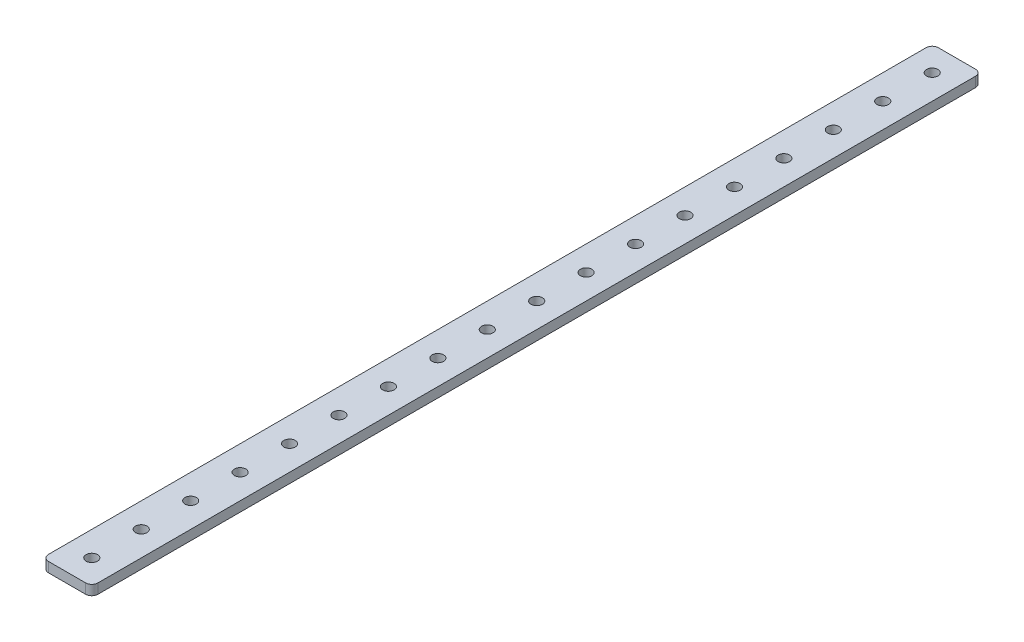
ISO-10303-21;
HEADER;
FILE_DESCRIPTION(('STEP AP214'),'2;1');
FILE_NAME('part.step','',(''),(''),'','','');
FILE_SCHEMA(('AUTOMOTIVE_DESIGN { 1 0 10303 214 1 1 1 1 }'));
ENDSEC;
DATA;
#1=APPLICATION_CONTEXT('core data for automotive mechanical design processes');
#2=APPLICATION_PROTOCOL_DEFINITION('international standard','automotive_design',2000,#1);
#3=PRODUCT_CONTEXT('',#1,'mechanical');
#4=PRODUCT('Part','Part','',(#3));
#5=PRODUCT_RELATED_PRODUCT_CATEGORY('part','',(#4));
#6=PRODUCT_DEFINITION_FORMATION('','',#4);
#7=PRODUCT_DEFINITION_CONTEXT('part definition',#1,'design');
#8=PRODUCT_DEFINITION('design','',#6,#7);
#9=PRODUCT_DEFINITION_SHAPE('','',#8);
#10=(LENGTH_UNIT() NAMED_UNIT(*) SI_UNIT(.MILLI.,.METRE.));
#11=(NAMED_UNIT(*) PLANE_ANGLE_UNIT() SI_UNIT($,.RADIAN.));
#12=(NAMED_UNIT(*) SI_UNIT($,.STERADIAN.) SOLID_ANGLE_UNIT());
#13=UNCERTAINTY_MEASURE_WITH_UNIT(LENGTH_MEASURE(1.E-05),#10,'distance_accuracy_value','');
#14=(GEOMETRIC_REPRESENTATION_CONTEXT(3) GLOBAL_UNCERTAINTY_ASSIGNED_CONTEXT((#13)) GLOBAL_UNIT_ASSIGNED_CONTEXT((#10,
#11,#12)) REPRESENTATION_CONTEXT('',''));
#15=CARTESIAN_POINT('',(0.,0.,0.));
#16=DIRECTION('',(0.,0.,1.));
#17=DIRECTION('',(1.,0.,0.));
#18=AXIS2_PLACEMENT_3D('',#15,#16,#17);
#19=CARTESIAN_POINT('',(6.,0.,-2.));
#20=DIRECTION('',(0.,1.,0.));
#21=DIRECTION('',(0.,0.,1.));
#22=AXIS2_PLACEMENT_3D('',#19,#20,#21);
#23=CYLINDRICAL_SURFACE('',#22,2.);
#24=CARTESIAN_POINT('',(6.,3.2,-2.));
#25=DIRECTION('',(0.,1.,0.));
#26=DIRECTION('',(0.,0.,1.));
#27=AXIS2_PLACEMENT_3D('',#24,#25,#26);
#28=CIRCLE('',#27,2.);
#29=CARTESIAN_POINT('',(6.,3.2,0.));
#30=VERTEX_POINT('',#29);
#31=CARTESIAN_POINT('',(8.,3.2,-2.));
#32=VERTEX_POINT('',#31);
#33=EDGE_CURVE('E130',#30,#32,#28,.T.);
#34=ORIENTED_EDGE('',*,*,#33,.F.);
#35=DIRECTION('',(0.,1.,0.));
#36=VECTOR('',#35,1.);
#37=CARTESIAN_POINT('',(6.,0.,0.));
#38=LINE('',#37,#36);
#39=CARTESIAN_POINT('',(6.,0.,0.));
#40=VERTEX_POINT('',#39);
#41=EDGE_CURVE('E11',#40,#30,#38,.T.);
#42=ORIENTED_EDGE('',*,*,#41,.F.);
#43=CARTESIAN_POINT('',(6.,0.,-2.));
#44=DIRECTION('',(0.,1.,0.));
#45=DIRECTION('',(0.,0.,1.));
#46=AXIS2_PLACEMENT_3D('',#43,#44,#45);
#47=CIRCLE('',#46,2.);
#48=CARTESIAN_POINT('',(8.,0.,-2.));
#49=VERTEX_POINT('',#48);
#50=EDGE_CURVE('E151',#40,#49,#47,.T.);
#51=ORIENTED_EDGE('',*,*,#50,.T.);
#52=DIRECTION('',(0.,1.,0.));
#53=VECTOR('',#52,1.);
#54=CARTESIAN_POINT('',(8.,0.,-2.));
#55=LINE('',#54,#53);
#56=EDGE_CURVE('E36',#49,#32,#55,.T.);
#57=ORIENTED_EDGE('',*,*,#56,.T.);
#58=EDGE_LOOP('',(#34,#42,#51,#57));
#59=FACE_BOUND('',#58,.T.);
#60=ADVANCED_FACE('F33',(#59),#23,.T.);
#61=CARTESIAN_POINT('',(-6.,0.,0.));
#62=DIRECTION('',(0.,0.,1.));
#63=DIRECTION('',(1.,0.,0.));
#64=AXIS2_PLACEMENT_3D('',#61,#62,#63);
#65=PLANE('',#64);
#66=DIRECTION('',(1.,0.,0.));
#67=VECTOR('',#66,1.);
#68=CARTESIAN_POINT('',(-6.,3.2,0.));
#69=LINE('',#68,#67);
#70=CARTESIAN_POINT('',(-6.,3.2,0.));
#71=VERTEX_POINT('',#70);
#72=EDGE_CURVE('E149',#71,#30,#69,.T.);
#73=ORIENTED_EDGE('',*,*,#72,.F.);
#74=DIRECTION('',(0.,1.,0.));
#75=VECTOR('',#74,1.);
#76=CARTESIAN_POINT('',(-6.,0.,0.));
#77=LINE('',#76,#75);
#78=CARTESIAN_POINT('',(-6.,0.,0.));
#79=VERTEX_POINT('',#78);
#80=EDGE_CURVE('E42',#79,#71,#77,.T.);
#81=ORIENTED_EDGE('',*,*,#80,.F.);
#82=DIRECTION('',(1.,0.,0.));
#83=VECTOR('',#82,1.);
#84=CARTESIAN_POINT('',(-6.,0.,0.));
#85=LINE('',#84,#83);
#86=EDGE_CURVE('E120',#79,#40,#85,.T.);
#87=ORIENTED_EDGE('',*,*,#86,.T.);
#88=ORIENTED_EDGE('',*,*,#41,.T.);
#89=EDGE_LOOP('',(#73,#81,#87,#88));
#90=FACE_BOUND('',#89,.T.);
#91=ADVANCED_FACE('F163',(#90),#65,.T.);
#92=CARTESIAN_POINT('',(-6.,0.,-2.));
#93=DIRECTION('',(0.,1.,0.));
#94=DIRECTION('',(0.,0.,1.));
#95=AXIS2_PLACEMENT_3D('',#92,#93,#94);
#96=CYLINDRICAL_SURFACE('',#95,2.);
#97=CARTESIAN_POINT('',(-6.,3.2,-2.));
#98=DIRECTION('',(0.,1.,0.));
#99=DIRECTION('',(0.,0.,1.));
#100=AXIS2_PLACEMENT_3D('',#97,#98,#99);
#101=CIRCLE('',#100,2.);
#102=CARTESIAN_POINT('',(-8.,3.2,-2.));
#103=VERTEX_POINT('',#102);
#104=EDGE_CURVE('E107',#103,#71,#101,.T.);
#105=ORIENTED_EDGE('',*,*,#104,.F.);
#106=DIRECTION('',(0.,1.,0.));
#107=VECTOR('',#106,1.);
#108=CARTESIAN_POINT('',(-8.,0.,-2.));
#109=LINE('',#108,#107);
#110=CARTESIAN_POINT('',(-8.,0.,-2.));
#111=VERTEX_POINT('',#110);
#112=EDGE_CURVE('E102',#111,#103,#109,.T.);
#113=ORIENTED_EDGE('',*,*,#112,.F.);
#114=CARTESIAN_POINT('',(-6.,0.,-2.));
#115=DIRECTION('',(0.,1.,0.));
#116=DIRECTION('',(0.,0.,1.));
#117=AXIS2_PLACEMENT_3D('',#114,#115,#116);
#118=CIRCLE('',#117,2.);
#119=EDGE_CURVE('E105',#111,#79,#118,.T.);
#120=ORIENTED_EDGE('',*,*,#119,.T.);
#121=ORIENTED_EDGE('',*,*,#80,.T.);
#122=EDGE_LOOP('',(#105,#113,#120,#121));
#123=FACE_BOUND('',#122,.T.);
#124=ADVANCED_FACE('F104',(#123),#96,.T.);
#125=CARTESIAN_POINT('',(-8.,0.,-286.));
#126=DIRECTION('',(-1.,0.,0.));
#127=DIRECTION('',(0.,0.,1.));
#128=AXIS2_PLACEMENT_3D('',#125,#126,#127);
#129=PLANE('',#128);
#130=DIRECTION('',(0.,0.,1.));
#131=VECTOR('',#130,1.);
#132=CARTESIAN_POINT('',(-8.,3.2,-286.));
#133=LINE('',#132,#131);
#134=CARTESIAN_POINT('',(-8.,3.2,-286.));
#135=VERTEX_POINT('',#134);
#136=EDGE_CURVE('E146',#135,#103,#133,.T.);
#137=ORIENTED_EDGE('',*,*,#136,.F.);
#138=DIRECTION('',(0.,1.,0.));
#139=VECTOR('',#138,1.);
#140=CARTESIAN_POINT('',(-8.,0.,-286.));
#141=LINE('',#140,#139);
#142=CARTESIAN_POINT('',(-8.,0.,-286.));
#143=VERTEX_POINT('',#142);
#144=EDGE_CURVE('E112',#143,#135,#141,.T.);
#145=ORIENTED_EDGE('',*,*,#144,.F.);
#146=DIRECTION('',(0.,0.,1.));
#147=VECTOR('',#146,1.);
#148=CARTESIAN_POINT('',(-8.,0.,-286.));
#149=LINE('',#148,#147);
#150=EDGE_CURVE('E118',#143,#111,#149,.T.);
#151=ORIENTED_EDGE('',*,*,#150,.T.);
#152=ORIENTED_EDGE('',*,*,#112,.T.);
#153=EDGE_LOOP('',(#137,#145,#151,#152));
#154=FACE_BOUND('',#153,.T.);
#155=ADVANCED_FACE('F122',(#154),#129,.T.);
#156=CARTESIAN_POINT('',(-6.,0.,-286.));
#157=DIRECTION('',(0.,1.,0.));
#158=DIRECTION('',(0.,0.,1.));
#159=AXIS2_PLACEMENT_3D('',#156,#157,#158);
#160=CYLINDRICAL_SURFACE('',#159,2.);
#161=CARTESIAN_POINT('',(-6.,3.2,-286.));
#162=DIRECTION('',(0.,1.,0.));
#163=DIRECTION('',(0.,0.,1.));
#164=AXIS2_PLACEMENT_3D('',#161,#162,#163);
#165=CIRCLE('',#164,2.);
#166=CARTESIAN_POINT('',(-6.,3.2,-288.));
#167=VERTEX_POINT('',#166);
#168=EDGE_CURVE('E143',#167,#135,#165,.T.);
#169=ORIENTED_EDGE('',*,*,#168,.F.);
#170=DIRECTION('',(0.,1.,0.));
#171=VECTOR('',#170,1.);
#172=CARTESIAN_POINT('',(-6.,0.,-288.));
#173=LINE('',#172,#171);
#174=CARTESIAN_POINT('',(-6.,0.,-288.));
#175=VERTEX_POINT('',#174);
#176=EDGE_CURVE('E155',#175,#167,#173,.T.);
#177=ORIENTED_EDGE('',*,*,#176,.F.);
#178=CARTESIAN_POINT('',(-6.,0.,-286.));
#179=DIRECTION('',(0.,1.,0.));
#180=DIRECTION('',(0.,0.,1.));
#181=AXIS2_PLACEMENT_3D('',#178,#179,#180);
#182=CIRCLE('',#181,2.);
#183=EDGE_CURVE('E123',#175,#143,#182,.T.);
#184=ORIENTED_EDGE('',*,*,#183,.T.);
#185=ORIENTED_EDGE('',*,*,#144,.T.);
#186=EDGE_LOOP('',(#169,#177,#184,#185));
#187=FACE_BOUND('',#186,.T.);
#188=ADVANCED_FACE('F176',(#187),#160,.T.);
#189=CARTESIAN_POINT('',(6.,0.,-288.));
#190=DIRECTION('',(0.,0.,-1.));
#191=DIRECTION('',(-1.,0.,0.));
#192=AXIS2_PLACEMENT_3D('',#189,#190,#191);
#193=PLANE('',#192);
#194=DIRECTION('',(-1.,0.,0.));
#195=VECTOR('',#194,1.);
#196=CARTESIAN_POINT('',(6.,3.2,-288.));
#197=LINE('',#196,#195);
#198=CARTESIAN_POINT('',(6.,3.2,-288.));
#199=VERTEX_POINT('',#198);
#200=EDGE_CURVE('E140',#199,#167,#197,.T.);
#201=ORIENTED_EDGE('',*,*,#200,.F.);
#202=DIRECTION('',(0.,1.,0.));
#203=VECTOR('',#202,1.);
#204=CARTESIAN_POINT('',(6.,0.,-288.));
#205=LINE('',#204,#203);
#206=CARTESIAN_POINT('',(6.,0.,-288.));
#207=VERTEX_POINT('',#206);
#208=EDGE_CURVE('E157',#207,#199,#205,.T.);
#209=ORIENTED_EDGE('',*,*,#208,.F.);
#210=DIRECTION('',(-1.,0.,0.));
#211=VECTOR('',#210,1.);
#212=CARTESIAN_POINT('',(6.,0.,-288.));
#213=LINE('',#212,#211);
#214=EDGE_CURVE('E125',#207,#175,#213,.T.);
#215=ORIENTED_EDGE('',*,*,#214,.T.);
#216=ORIENTED_EDGE('',*,*,#176,.T.);
#217=EDGE_LOOP('',(#201,#209,#215,#216));
#218=FACE_BOUND('',#217,.T.);
#219=ADVANCED_FACE('F179',(#218),#193,.T.);
#220=CARTESIAN_POINT('',(6.,0.,-286.));
#221=DIRECTION('',(0.,1.,0.));
#222=DIRECTION('',(0.,0.,1.));
#223=AXIS2_PLACEMENT_3D('',#220,#221,#222);
#224=CYLINDRICAL_SURFACE('',#223,2.);
#225=CARTESIAN_POINT('',(6.,3.2,-286.));
#226=DIRECTION('',(0.,1.,0.));
#227=DIRECTION('',(0.,0.,1.));
#228=AXIS2_PLACEMENT_3D('',#225,#226,#227);
#229=CIRCLE('',#228,2.);
#230=CARTESIAN_POINT('',(8.,3.2,-286.));
#231=VERTEX_POINT('',#230);
#232=EDGE_CURVE('E137',#231,#199,#229,.T.);
#233=ORIENTED_EDGE('',*,*,#232,.F.);
#234=DIRECTION('',(0.,1.,0.));
#235=VECTOR('',#234,1.);
#236=CARTESIAN_POINT('',(8.,0.,-286.));
#237=LINE('',#236,#235);
#238=CARTESIAN_POINT('',(8.,0.,-286.));
#239=VERTEX_POINT('',#238);
#240=EDGE_CURVE('E158',#239,#231,#237,.T.);
#241=ORIENTED_EDGE('',*,*,#240,.F.);
#242=CARTESIAN_POINT('',(6.,0.,-286.));
#243=DIRECTION('',(0.,1.,0.));
#244=DIRECTION('',(0.,0.,1.));
#245=AXIS2_PLACEMENT_3D('',#242,#243,#244);
#246=CIRCLE('',#245,2.);
#247=EDGE_CURVE('E385',#239,#207,#246,.T.);
#248=ORIENTED_EDGE('',*,*,#247,.T.);
#249=ORIENTED_EDGE('',*,*,#208,.T.);
#250=EDGE_LOOP('',(#233,#241,#248,#249));
#251=FACE_BOUND('',#250,.T.);
#252=ADVANCED_FACE('F183',(#251),#224,.T.);
#253=CARTESIAN_POINT('',(8.,0.,-2.));
#254=DIRECTION('',(1.,0.,0.));
#255=DIRECTION('',(0.,0.,-1.));
#256=AXIS2_PLACEMENT_3D('',#253,#254,#255);
#257=PLANE('',#256);
#258=DIRECTION('',(0.,0.,-1.));
#259=VECTOR('',#258,1.);
#260=CARTESIAN_POINT('',(8.,3.2,-2.));
#261=LINE('',#260,#259);
#262=EDGE_CURVE('E133',#32,#231,#261,.T.);
#263=ORIENTED_EDGE('',*,*,#262,.F.);
#264=ORIENTED_EDGE('',*,*,#56,.F.);
#265=DIRECTION('',(0.,0.,-1.));
#266=VECTOR('',#265,1.);
#267=CARTESIAN_POINT('',(8.,0.,-2.));
#268=LINE('',#267,#266);
#269=EDGE_CURVE('E383',#49,#239,#268,.T.);
#270=ORIENTED_EDGE('',*,*,#269,.T.);
#271=ORIENTED_EDGE('',*,*,#240,.T.);
#272=EDGE_LOOP('',(#263,#264,#270,#271));
#273=FACE_BOUND('',#272,.T.);
#274=ADVANCED_FACE('F160',(#273),#257,.T.);
#275=CARTESIAN_POINT('',(6.,0.,-2.));
#276=DIRECTION('',(0.,1.,0.));
#277=DIRECTION('',(0.,0.,1.));
#278=AXIS2_PLACEMENT_3D('',#275,#276,#277);
#279=PLANE('',#278);
#280=CARTESIAN_POINT('',(0.,0.,-8.));
#281=DIRECTION('',(0.,1.,0.));
#282=DIRECTION('',(0.,0.,-1.));
#283=AXIS2_PLACEMENT_3D('',#280,#281,#282);
#284=CIRCLE('',#283,1.85);
#285=CARTESIAN_POINT('',(0.,0.,-9.85));
#286=VERTEX_POINT('',#285);
#287=EDGE_CURVE('E274',#286,#286,#284,.T.);
#288=ORIENTED_EDGE('',*,*,#287,.T.);
#289=EDGE_LOOP('',(#288));
#290=FACE_BOUND('',#289,.T.);
#291=CARTESIAN_POINT('',(0.,0.,-24.));
#292=DIRECTION('',(0.,1.,0.));
#293=DIRECTION('',(0.,0.,-1.));
#294=AXIS2_PLACEMENT_3D('',#291,#292,#293);
#295=CIRCLE('',#294,1.85);
#296=CARTESIAN_POINT('',(0.,0.,-25.85));
#297=VERTEX_POINT('',#296);
#298=EDGE_CURVE('E282',#297,#297,#295,.T.);
#299=ORIENTED_EDGE('',*,*,#298,.T.);
#300=EDGE_LOOP('',(#299));
#301=FACE_BOUND('',#300,.T.);
#302=CARTESIAN_POINT('',(0.,0.,-40.));
#303=DIRECTION('',(0.,1.,0.));
#304=DIRECTION('',(0.,0.,-1.));
#305=AXIS2_PLACEMENT_3D('',#302,#303,#304);
#306=CIRCLE('',#305,1.85);
#307=CARTESIAN_POINT('',(0.,0.,-41.85));
#308=VERTEX_POINT('',#307);
#309=EDGE_CURVE('E288',#308,#308,#306,.T.);
#310=ORIENTED_EDGE('',*,*,#309,.T.);
#311=EDGE_LOOP('',(#310));
#312=FACE_BOUND('',#311,.T.);
#313=CARTESIAN_POINT('',(0.,0.,-56.));
#314=DIRECTION('',(0.,1.,0.));
#315=DIRECTION('',(0.,0.,-1.));
#316=AXIS2_PLACEMENT_3D('',#313,#314,#315);
#317=CIRCLE('',#316,1.85);
#318=CARTESIAN_POINT('',(0.,0.,-57.85));
#319=VERTEX_POINT('',#318);
#320=EDGE_CURVE('E294',#319,#319,#317,.T.);
#321=ORIENTED_EDGE('',*,*,#320,.T.);
#322=EDGE_LOOP('',(#321));
#323=FACE_BOUND('',#322,.T.);
#324=CARTESIAN_POINT('',(0.,0.,-72.));
#325=DIRECTION('',(0.,1.,0.));
#326=DIRECTION('',(0.,0.,-1.));
#327=AXIS2_PLACEMENT_3D('',#324,#325,#326);
#328=CIRCLE('',#327,1.85);
#329=CARTESIAN_POINT('',(0.,0.,-73.85));
#330=VERTEX_POINT('',#329);
#331=EDGE_CURVE('E300',#330,#330,#328,.T.);
#332=ORIENTED_EDGE('',*,*,#331,.T.);
#333=EDGE_LOOP('',(#332));
#334=FACE_BOUND('',#333,.T.);
#335=CARTESIAN_POINT('',(0.,0.,-88.));
#336=DIRECTION('',(0.,1.,0.));
#337=DIRECTION('',(0.,0.,-1.));
#338=AXIS2_PLACEMENT_3D('',#335,#336,#337);
#339=CIRCLE('',#338,1.85);
#340=CARTESIAN_POINT('',(0.,0.,-89.85));
#341=VERTEX_POINT('',#340);
#342=EDGE_CURVE('E306',#341,#341,#339,.T.);
#343=ORIENTED_EDGE('',*,*,#342,.T.);
#344=EDGE_LOOP('',(#343));
#345=FACE_BOUND('',#344,.T.);
#346=CARTESIAN_POINT('',(0.,0.,-104.));
#347=DIRECTION('',(0.,1.,0.));
#348=DIRECTION('',(0.,0.,-1.));
#349=AXIS2_PLACEMENT_3D('',#346,#347,#348);
#350=CIRCLE('',#349,1.85);
#351=CARTESIAN_POINT('',(0.,0.,-105.85));
#352=VERTEX_POINT('',#351);
#353=EDGE_CURVE('E312',#352,#352,#350,.T.);
#354=ORIENTED_EDGE('',*,*,#353,.T.);
#355=EDGE_LOOP('',(#354));
#356=FACE_BOUND('',#355,.T.);
#357=CARTESIAN_POINT('',(0.,0.,-120.));
#358=DIRECTION('',(0.,1.,0.));
#359=DIRECTION('',(0.,0.,-1.));
#360=AXIS2_PLACEMENT_3D('',#357,#358,#359);
#361=CIRCLE('',#360,1.85);
#362=CARTESIAN_POINT('',(0.,0.,-121.85));
#363=VERTEX_POINT('',#362);
#364=EDGE_CURVE('E318',#363,#363,#361,.T.);
#365=ORIENTED_EDGE('',*,*,#364,.T.);
#366=EDGE_LOOP('',(#365));
#367=FACE_BOUND('',#366,.T.);
#368=CARTESIAN_POINT('',(0.,0.,-136.));
#369=DIRECTION('',(0.,1.,0.));
#370=DIRECTION('',(0.,0.,-1.));
#371=AXIS2_PLACEMENT_3D('',#368,#369,#370);
#372=CIRCLE('',#371,1.84999999999999);
#373=CARTESIAN_POINT('',(0.,0.,-137.85));
#374=VERTEX_POINT('',#373);
#375=EDGE_CURVE('E324',#374,#374,#372,.T.);
#376=ORIENTED_EDGE('',*,*,#375,.T.);
#377=EDGE_LOOP('',(#376));
#378=FACE_BOUND('',#377,.T.);
#379=CARTESIAN_POINT('',(0.,0.,-152.));
#380=DIRECTION('',(0.,1.,0.));
#381=DIRECTION('',(0.,0.,-1.));
#382=AXIS2_PLACEMENT_3D('',#379,#380,#381);
#383=CIRCLE('',#382,1.84999999999999);
#384=CARTESIAN_POINT('',(0.,0.,-153.85));
#385=VERTEX_POINT('',#384);
#386=EDGE_CURVE('E330',#385,#385,#383,.T.);
#387=ORIENTED_EDGE('',*,*,#386,.T.);
#388=EDGE_LOOP('',(#387));
#389=FACE_BOUND('',#388,.T.);
#390=CARTESIAN_POINT('',(0.,0.,-168.));
#391=DIRECTION('',(0.,1.,0.));
#392=DIRECTION('',(0.,0.,-1.));
#393=AXIS2_PLACEMENT_3D('',#390,#391,#392);
#394=CIRCLE('',#393,1.84999999999999);
#395=CARTESIAN_POINT('',(0.,0.,-169.85));
#396=VERTEX_POINT('',#395);
#397=EDGE_CURVE('E336',#396,#396,#394,.T.);
#398=ORIENTED_EDGE('',*,*,#397,.T.);
#399=EDGE_LOOP('',(#398));
#400=FACE_BOUND('',#399,.T.);
#401=CARTESIAN_POINT('',(0.,0.,-184.));
#402=DIRECTION('',(0.,1.,0.));
#403=DIRECTION('',(0.,0.,-1.));
#404=AXIS2_PLACEMENT_3D('',#401,#402,#403);
#405=CIRCLE('',#404,1.84999999999999);
#406=CARTESIAN_POINT('',(0.,0.,-185.85));
#407=VERTEX_POINT('',#406);
#408=EDGE_CURVE('E342',#407,#407,#405,.T.);
#409=ORIENTED_EDGE('',*,*,#408,.T.);
#410=EDGE_LOOP('',(#409));
#411=FACE_BOUND('',#410,.T.);
#412=CARTESIAN_POINT('',(0.,0.,-200.));
#413=DIRECTION('',(0.,1.,0.));
#414=DIRECTION('',(0.,0.,-1.));
#415=AXIS2_PLACEMENT_3D('',#412,#413,#414);
#416=CIRCLE('',#415,1.84999999999999);
#417=CARTESIAN_POINT('',(0.,0.,-201.85));
#418=VERTEX_POINT('',#417);
#419=EDGE_CURVE('E348',#418,#418,#416,.T.);
#420=ORIENTED_EDGE('',*,*,#419,.T.);
#421=EDGE_LOOP('',(#420));
#422=FACE_BOUND('',#421,.T.);
#423=CARTESIAN_POINT('',(0.,0.,-216.));
#424=DIRECTION('',(0.,1.,0.));
#425=DIRECTION('',(0.,0.,-1.));
#426=AXIS2_PLACEMENT_3D('',#423,#424,#425);
#427=CIRCLE('',#426,1.84999999999999);
#428=CARTESIAN_POINT('',(0.,0.,-217.85));
#429=VERTEX_POINT('',#428);
#430=EDGE_CURVE('E354',#429,#429,#427,.T.);
#431=ORIENTED_EDGE('',*,*,#430,.T.);
#432=EDGE_LOOP('',(#431));
#433=FACE_BOUND('',#432,.T.);
#434=CARTESIAN_POINT('',(0.,0.,-232.));
#435=DIRECTION('',(0.,1.,0.));
#436=DIRECTION('',(0.,0.,-1.));
#437=AXIS2_PLACEMENT_3D('',#434,#435,#436);
#438=CIRCLE('',#437,1.84999999999999);
#439=CARTESIAN_POINT('',(0.,0.,-233.85));
#440=VERTEX_POINT('',#439);
#441=EDGE_CURVE('E360',#440,#440,#438,.T.);
#442=ORIENTED_EDGE('',*,*,#441,.T.);
#443=EDGE_LOOP('',(#442));
#444=FACE_BOUND('',#443,.T.);
#445=CARTESIAN_POINT('',(0.,0.,-248.));
#446=DIRECTION('',(0.,1.,0.));
#447=DIRECTION('',(0.,0.,-1.));
#448=AXIS2_PLACEMENT_3D('',#445,#446,#447);
#449=CIRCLE('',#448,1.84999999999999);
#450=CARTESIAN_POINT('',(0.,0.,-249.85));
#451=VERTEX_POINT('',#450);
#452=EDGE_CURVE('E366',#451,#451,#449,.T.);
#453=ORIENTED_EDGE('',*,*,#452,.T.);
#454=EDGE_LOOP('',(#453));
#455=FACE_BOUND('',#454,.T.);
#456=CARTESIAN_POINT('',(0.,0.,-264.));
#457=DIRECTION('',(0.,1.,0.));
#458=DIRECTION('',(0.,0.,-1.));
#459=AXIS2_PLACEMENT_3D('',#456,#457,#458);
#460=CIRCLE('',#459,1.85000000000002);
#461=CARTESIAN_POINT('',(0.,0.,-265.85));
#462=VERTEX_POINT('',#461);
#463=EDGE_CURVE('E372',#462,#462,#460,.T.);
#464=ORIENTED_EDGE('',*,*,#463,.T.);
#465=EDGE_LOOP('',(#464));
#466=FACE_BOUND('',#465,.T.);
#467=CARTESIAN_POINT('',(0.,0.,-280.));
#468=DIRECTION('',(0.,1.,0.));
#469=DIRECTION('',(0.,0.,-1.));
#470=AXIS2_PLACEMENT_3D('',#467,#468,#469);
#471=CIRCLE('',#470,1.85000000000002);
#472=CARTESIAN_POINT('',(0.,0.,-281.85));
#473=VERTEX_POINT('',#472);
#474=EDGE_CURVE('E134',#473,#473,#471,.T.);
#475=ORIENTED_EDGE('',*,*,#474,.T.);
#476=EDGE_LOOP('',(#475));
#477=FACE_BOUND('',#476,.T.);
#478=ORIENTED_EDGE('',*,*,#50,.F.);
#479=ORIENTED_EDGE('',*,*,#86,.F.);
#480=ORIENTED_EDGE('',*,*,#119,.F.);
#481=ORIENTED_EDGE('',*,*,#150,.F.);
#482=ORIENTED_EDGE('',*,*,#183,.F.);
#483=ORIENTED_EDGE('',*,*,#214,.F.);
#484=ORIENTED_EDGE('',*,*,#247,.F.);
#485=ORIENTED_EDGE('',*,*,#269,.F.);
#486=EDGE_LOOP('',(#478,#479,#480,#481,#482,#483,#484,#485));
#487=FACE_BOUND('',#486,.T.);
#488=ADVANCED_FACE('F116',(#290,#301,#312,#323,#334,#345,#356,#367,#378,#389,#400,#411,#422,
#433,#444,#455,#466,#477,#487),#279,.F.);
#489=CARTESIAN_POINT('',(6.,3.2,-2.));
#490=DIRECTION('',(0.,1.,0.));
#491=DIRECTION('',(0.,0.,1.));
#492=AXIS2_PLACEMENT_3D('',#489,#490,#491);
#493=PLANE('',#492);
#494=CARTESIAN_POINT('',(0.,3.2,-8.));
#495=DIRECTION('',(0.,1.,0.));
#496=DIRECTION('',(0.,0.,-1.));
#497=AXIS2_PLACEMENT_3D('',#494,#495,#496);
#498=CIRCLE('',#497,1.85);
#499=CARTESIAN_POINT('',(0.,3.2,-9.85));
#500=VERTEX_POINT('',#499);
#501=EDGE_CURVE('E277',#500,#500,#498,.T.);
#502=ORIENTED_EDGE('',*,*,#501,.F.);
#503=EDGE_LOOP('',(#502));
#504=FACE_BOUND('',#503,.T.);
#505=CARTESIAN_POINT('',(0.,3.2,-24.));
#506=DIRECTION('',(0.,1.,0.));
#507=DIRECTION('',(0.,0.,-1.));
#508=AXIS2_PLACEMENT_3D('',#505,#506,#507);
#509=CIRCLE('',#508,1.85);
#510=CARTESIAN_POINT('',(0.,3.2,-25.85));
#511=VERTEX_POINT('',#510);
#512=EDGE_CURVE('E279',#511,#511,#509,.T.);
#513=ORIENTED_EDGE('',*,*,#512,.F.);
#514=EDGE_LOOP('',(#513));
#515=FACE_BOUND('',#514,.T.);
#516=CARTESIAN_POINT('',(0.,3.2,-40.));
#517=DIRECTION('',(0.,1.,0.));
#518=DIRECTION('',(0.,0.,-1.));
#519=AXIS2_PLACEMENT_3D('',#516,#517,#518);
#520=CIRCLE('',#519,1.85);
#521=CARTESIAN_POINT('',(0.,3.2,-41.85));
#522=VERTEX_POINT('',#521);
#523=EDGE_CURVE('E285',#522,#522,#520,.T.);
#524=ORIENTED_EDGE('',*,*,#523,.F.);
#525=EDGE_LOOP('',(#524));
#526=FACE_BOUND('',#525,.T.);
#527=CARTESIAN_POINT('',(0.,3.2,-56.));
#528=DIRECTION('',(0.,1.,0.));
#529=DIRECTION('',(0.,0.,-1.));
#530=AXIS2_PLACEMENT_3D('',#527,#528,#529);
#531=CIRCLE('',#530,1.85);
#532=CARTESIAN_POINT('',(0.,3.2,-57.85));
#533=VERTEX_POINT('',#532);
#534=EDGE_CURVE('E291',#533,#533,#531,.T.);
#535=ORIENTED_EDGE('',*,*,#534,.F.);
#536=EDGE_LOOP('',(#535));
#537=FACE_BOUND('',#536,.T.);
#538=CARTESIAN_POINT('',(0.,3.2,-72.));
#539=DIRECTION('',(0.,1.,0.));
#540=DIRECTION('',(0.,0.,-1.));
#541=AXIS2_PLACEMENT_3D('',#538,#539,#540);
#542=CIRCLE('',#541,1.85);
#543=CARTESIAN_POINT('',(0.,3.2,-73.85));
#544=VERTEX_POINT('',#543);
#545=EDGE_CURVE('E297',#544,#544,#542,.T.);
#546=ORIENTED_EDGE('',*,*,#545,.F.);
#547=EDGE_LOOP('',(#546));
#548=FACE_BOUND('',#547,.T.);
#549=CARTESIAN_POINT('',(0.,3.2,-88.));
#550=DIRECTION('',(0.,1.,0.));
#551=DIRECTION('',(0.,0.,-1.));
#552=AXIS2_PLACEMENT_3D('',#549,#550,#551);
#553=CIRCLE('',#552,1.85);
#554=CARTESIAN_POINT('',(0.,3.2,-89.85));
#555=VERTEX_POINT('',#554);
#556=EDGE_CURVE('E303',#555,#555,#553,.T.);
#557=ORIENTED_EDGE('',*,*,#556,.F.);
#558=EDGE_LOOP('',(#557));
#559=FACE_BOUND('',#558,.T.);
#560=CARTESIAN_POINT('',(0.,3.2,-104.));
#561=DIRECTION('',(0.,1.,0.));
#562=DIRECTION('',(0.,0.,-1.));
#563=AXIS2_PLACEMENT_3D('',#560,#561,#562);
#564=CIRCLE('',#563,1.85);
#565=CARTESIAN_POINT('',(0.,3.2,-105.85));
#566=VERTEX_POINT('',#565);
#567=EDGE_CURVE('E309',#566,#566,#564,.T.);
#568=ORIENTED_EDGE('',*,*,#567,.F.);
#569=EDGE_LOOP('',(#568));
#570=FACE_BOUND('',#569,.T.);
#571=CARTESIAN_POINT('',(0.,3.2,-120.));
#572=DIRECTION('',(0.,1.,0.));
#573=DIRECTION('',(0.,0.,-1.));
#574=AXIS2_PLACEMENT_3D('',#571,#572,#573);
#575=CIRCLE('',#574,1.85);
#576=CARTESIAN_POINT('',(0.,3.2,-121.85));
#577=VERTEX_POINT('',#576);
#578=EDGE_CURVE('E315',#577,#577,#575,.T.);
#579=ORIENTED_EDGE('',*,*,#578,.F.);
#580=EDGE_LOOP('',(#579));
#581=FACE_BOUND('',#580,.T.);
#582=CARTESIAN_POINT('',(0.,3.2,-136.));
#583=DIRECTION('',(0.,1.,0.));
#584=DIRECTION('',(0.,0.,-1.));
#585=AXIS2_PLACEMENT_3D('',#582,#583,#584);
#586=CIRCLE('',#585,1.84999999999999);
#587=CARTESIAN_POINT('',(0.,3.2,-137.85));
#588=VERTEX_POINT('',#587);
#589=EDGE_CURVE('E321',#588,#588,#586,.T.);
#590=ORIENTED_EDGE('',*,*,#589,.F.);
#591=EDGE_LOOP('',(#590));
#592=FACE_BOUND('',#591,.T.);
#593=CARTESIAN_POINT('',(0.,3.2,-152.));
#594=DIRECTION('',(0.,1.,0.));
#595=DIRECTION('',(0.,0.,-1.));
#596=AXIS2_PLACEMENT_3D('',#593,#594,#595);
#597=CIRCLE('',#596,1.84999999999999);
#598=CARTESIAN_POINT('',(0.,3.2,-153.85));
#599=VERTEX_POINT('',#598);
#600=EDGE_CURVE('E327',#599,#599,#597,.T.);
#601=ORIENTED_EDGE('',*,*,#600,.F.);
#602=EDGE_LOOP('',(#601));
#603=FACE_BOUND('',#602,.T.);
#604=CARTESIAN_POINT('',(0.,3.2,-168.));
#605=DIRECTION('',(0.,1.,0.));
#606=DIRECTION('',(0.,0.,-1.));
#607=AXIS2_PLACEMENT_3D('',#604,#605,#606);
#608=CIRCLE('',#607,1.84999999999999);
#609=CARTESIAN_POINT('',(0.,3.2,-169.85));
#610=VERTEX_POINT('',#609);
#611=EDGE_CURVE('E333',#610,#610,#608,.T.);
#612=ORIENTED_EDGE('',*,*,#611,.F.);
#613=EDGE_LOOP('',(#612));
#614=FACE_BOUND('',#613,.T.);
#615=CARTESIAN_POINT('',(0.,3.2,-184.));
#616=DIRECTION('',(0.,1.,0.));
#617=DIRECTION('',(0.,0.,-1.));
#618=AXIS2_PLACEMENT_3D('',#615,#616,#617);
#619=CIRCLE('',#618,1.84999999999999);
#620=CARTESIAN_POINT('',(0.,3.2,-185.85));
#621=VERTEX_POINT('',#620);
#622=EDGE_CURVE('E339',#621,#621,#619,.T.);
#623=ORIENTED_EDGE('',*,*,#622,.F.);
#624=EDGE_LOOP('',(#623));
#625=FACE_BOUND('',#624,.T.);
#626=CARTESIAN_POINT('',(0.,3.2,-200.));
#627=DIRECTION('',(0.,1.,0.));
#628=DIRECTION('',(0.,0.,-1.));
#629=AXIS2_PLACEMENT_3D('',#626,#627,#628);
#630=CIRCLE('',#629,1.84999999999999);
#631=CARTESIAN_POINT('',(0.,3.2,-201.85));
#632=VERTEX_POINT('',#631);
#633=EDGE_CURVE('E345',#632,#632,#630,.T.);
#634=ORIENTED_EDGE('',*,*,#633,.F.);
#635=EDGE_LOOP('',(#634));
#636=FACE_BOUND('',#635,.T.);
#637=CARTESIAN_POINT('',(0.,3.2,-216.));
#638=DIRECTION('',(0.,1.,0.));
#639=DIRECTION('',(0.,0.,-1.));
#640=AXIS2_PLACEMENT_3D('',#637,#638,#639);
#641=CIRCLE('',#640,1.84999999999999);
#642=CARTESIAN_POINT('',(0.,3.2,-217.85));
#643=VERTEX_POINT('',#642);
#644=EDGE_CURVE('E351',#643,#643,#641,.T.);
#645=ORIENTED_EDGE('',*,*,#644,.F.);
#646=EDGE_LOOP('',(#645));
#647=FACE_BOUND('',#646,.T.);
#648=CARTESIAN_POINT('',(0.,3.2,-232.));
#649=DIRECTION('',(0.,1.,0.));
#650=DIRECTION('',(0.,0.,-1.));
#651=AXIS2_PLACEMENT_3D('',#648,#649,#650);
#652=CIRCLE('',#651,1.84999999999999);
#653=CARTESIAN_POINT('',(0.,3.2,-233.85));
#654=VERTEX_POINT('',#653);
#655=EDGE_CURVE('E357',#654,#654,#652,.T.);
#656=ORIENTED_EDGE('',*,*,#655,.F.);
#657=EDGE_LOOP('',(#656));
#658=FACE_BOUND('',#657,.T.);
#659=CARTESIAN_POINT('',(0.,3.2,-248.));
#660=DIRECTION('',(0.,1.,0.));
#661=DIRECTION('',(0.,0.,-1.));
#662=AXIS2_PLACEMENT_3D('',#659,#660,#661);
#663=CIRCLE('',#662,1.84999999999999);
#664=CARTESIAN_POINT('',(0.,3.2,-249.85));
#665=VERTEX_POINT('',#664);
#666=EDGE_CURVE('E363',#665,#665,#663,.T.);
#667=ORIENTED_EDGE('',*,*,#666,.F.);
#668=EDGE_LOOP('',(#667));
#669=FACE_BOUND('',#668,.T.);
#670=CARTESIAN_POINT('',(0.,3.2,-264.));
#671=DIRECTION('',(0.,1.,0.));
#672=DIRECTION('',(0.,0.,-1.));
#673=AXIS2_PLACEMENT_3D('',#670,#671,#672);
#674=CIRCLE('',#673,1.85000000000002);
#675=CARTESIAN_POINT('',(0.,3.2,-265.85));
#676=VERTEX_POINT('',#675);
#677=EDGE_CURVE('E369',#676,#676,#674,.T.);
#678=ORIENTED_EDGE('',*,*,#677,.F.);
#679=EDGE_LOOP('',(#678));
#680=FACE_BOUND('',#679,.T.);
#681=CARTESIAN_POINT('',(0.,3.2,-280.));
#682=DIRECTION('',(0.,1.,0.));
#683=DIRECTION('',(0.,0.,-1.));
#684=AXIS2_PLACEMENT_3D('',#681,#682,#683);
#685=CIRCLE('',#684,1.85000000000002);
#686=CARTESIAN_POINT('',(0.,3.2,-281.85));
#687=VERTEX_POINT('',#686);
#688=EDGE_CURVE('E375',#687,#687,#685,.T.);
#689=ORIENTED_EDGE('',*,*,#688,.F.);
#690=EDGE_LOOP('',(#689));
#691=FACE_BOUND('',#690,.T.);
#692=ORIENTED_EDGE('',*,*,#33,.T.);
#693=ORIENTED_EDGE('',*,*,#262,.T.);
#694=ORIENTED_EDGE('',*,*,#232,.T.);
#695=ORIENTED_EDGE('',*,*,#200,.T.);
#696=ORIENTED_EDGE('',*,*,#168,.T.);
#697=ORIENTED_EDGE('',*,*,#136,.T.);
#698=ORIENTED_EDGE('',*,*,#104,.T.);
#699=ORIENTED_EDGE('',*,*,#72,.T.);
#700=EDGE_LOOP('',(#692,#693,#694,#695,#696,#697,#698,#699));
#701=FACE_BOUND('',#700,.T.);
#702=ADVANCED_FACE('F162',(#504,#515,#526,#537,#548,#559,#570,#581,#592,#603,#614,#625,#636,
#647,#658,#669,#680,#691,#701),#493,.T.);
#703=CARTESIAN_POINT('',(0.,0.,-280.));
#704=DIRECTION('',(0.,1.,0.));
#705=DIRECTION('',(0.,0.,1.));
#706=AXIS2_PLACEMENT_3D('',#703,#704,#705);
#707=CYLINDRICAL_SURFACE('',#706,1.85000000000002);
#708=ORIENTED_EDGE('',*,*,#474,.F.);
#709=EDGE_LOOP('',(#708));
#710=FACE_BOUND('',#709,.T.);
#711=ORIENTED_EDGE('',*,*,#688,.T.);
#712=EDGE_LOOP('',(#711));
#713=FACE_BOUND('',#712,.T.);
#714=ADVANCED_FACE('F195',(#710,#713),#707,.F.);
#715=CARTESIAN_POINT('',(0.,0.,-264.));
#716=DIRECTION('',(0.,1.,0.));
#717=DIRECTION('',(0.,0.,1.));
#718=AXIS2_PLACEMENT_3D('',#715,#716,#717);
#719=CYLINDRICAL_SURFACE('',#718,1.85000000000002);
#720=ORIENTED_EDGE('',*,*,#463,.F.);
#721=EDGE_LOOP('',(#720));
#722=FACE_BOUND('',#721,.T.);
#723=ORIENTED_EDGE('',*,*,#677,.T.);
#724=EDGE_LOOP('',(#723));
#725=FACE_BOUND('',#724,.T.);
#726=ADVANCED_FACE('F202',(#722,#725),#719,.F.);
#727=CARTESIAN_POINT('',(0.,0.,-248.));
#728=DIRECTION('',(0.,1.,0.));
#729=DIRECTION('',(0.,0.,1.));
#730=AXIS2_PLACEMENT_3D('',#727,#728,#729);
#731=CYLINDRICAL_SURFACE('',#730,1.84999999999999);
#732=ORIENTED_EDGE('',*,*,#452,.F.);
#733=EDGE_LOOP('',(#732));
#734=FACE_BOUND('',#733,.T.);
#735=ORIENTED_EDGE('',*,*,#666,.T.);
#736=EDGE_LOOP('',(#735));
#737=FACE_BOUND('',#736,.T.);
#738=ADVANCED_FACE('F206',(#734,#737),#731,.F.);
#739=CARTESIAN_POINT('',(0.,0.,-232.));
#740=DIRECTION('',(0.,1.,0.));
#741=DIRECTION('',(0.,0.,1.));
#742=AXIS2_PLACEMENT_3D('',#739,#740,#741);
#743=CYLINDRICAL_SURFACE('',#742,1.84999999999999);
#744=ORIENTED_EDGE('',*,*,#441,.F.);
#745=EDGE_LOOP('',(#744));
#746=FACE_BOUND('',#745,.T.);
#747=ORIENTED_EDGE('',*,*,#655,.T.);
#748=EDGE_LOOP('',(#747));
#749=FACE_BOUND('',#748,.T.);
#750=ADVANCED_FACE('F210',(#746,#749),#743,.F.);
#751=CARTESIAN_POINT('',(0.,0.,-216.));
#752=DIRECTION('',(0.,1.,0.));
#753=DIRECTION('',(0.,0.,1.));
#754=AXIS2_PLACEMENT_3D('',#751,#752,#753);
#755=CYLINDRICAL_SURFACE('',#754,1.84999999999999);
#756=ORIENTED_EDGE('',*,*,#430,.F.);
#757=EDGE_LOOP('',(#756));
#758=FACE_BOUND('',#757,.T.);
#759=ORIENTED_EDGE('',*,*,#644,.T.);
#760=EDGE_LOOP('',(#759));
#761=FACE_BOUND('',#760,.T.);
#762=ADVANCED_FACE('F214',(#758,#761),#755,.F.);
#763=CARTESIAN_POINT('',(0.,0.,-200.));
#764=DIRECTION('',(0.,1.,0.));
#765=DIRECTION('',(0.,0.,1.));
#766=AXIS2_PLACEMENT_3D('',#763,#764,#765);
#767=CYLINDRICAL_SURFACE('',#766,1.84999999999999);
#768=ORIENTED_EDGE('',*,*,#419,.F.);
#769=EDGE_LOOP('',(#768));
#770=FACE_BOUND('',#769,.T.);
#771=ORIENTED_EDGE('',*,*,#633,.T.);
#772=EDGE_LOOP('',(#771));
#773=FACE_BOUND('',#772,.T.);
#774=ADVANCED_FACE('F218',(#770,#773),#767,.F.);
#775=CARTESIAN_POINT('',(0.,0.,-184.));
#776=DIRECTION('',(0.,1.,0.));
#777=DIRECTION('',(0.,0.,1.));
#778=AXIS2_PLACEMENT_3D('',#775,#776,#777);
#779=CYLINDRICAL_SURFACE('',#778,1.84999999999999);
#780=ORIENTED_EDGE('',*,*,#408,.F.);
#781=EDGE_LOOP('',(#780));
#782=FACE_BOUND('',#781,.T.);
#783=ORIENTED_EDGE('',*,*,#622,.T.);
#784=EDGE_LOOP('',(#783));
#785=FACE_BOUND('',#784,.T.);
#786=ADVANCED_FACE('F222',(#782,#785),#779,.F.);
#787=CARTESIAN_POINT('',(0.,0.,-168.));
#788=DIRECTION('',(0.,1.,0.));
#789=DIRECTION('',(0.,0.,1.));
#790=AXIS2_PLACEMENT_3D('',#787,#788,#789);
#791=CYLINDRICAL_SURFACE('',#790,1.84999999999999);
#792=ORIENTED_EDGE('',*,*,#397,.F.);
#793=EDGE_LOOP('',(#792));
#794=FACE_BOUND('',#793,.T.);
#795=ORIENTED_EDGE('',*,*,#611,.T.);
#796=EDGE_LOOP('',(#795));
#797=FACE_BOUND('',#796,.T.);
#798=ADVANCED_FACE('F226',(#794,#797),#791,.F.);
#799=CARTESIAN_POINT('',(0.,0.,-152.));
#800=DIRECTION('',(0.,1.,0.));
#801=DIRECTION('',(0.,0.,1.));
#802=AXIS2_PLACEMENT_3D('',#799,#800,#801);
#803=CYLINDRICAL_SURFACE('',#802,1.84999999999999);
#804=ORIENTED_EDGE('',*,*,#386,.F.);
#805=EDGE_LOOP('',(#804));
#806=FACE_BOUND('',#805,.T.);
#807=ORIENTED_EDGE('',*,*,#600,.T.);
#808=EDGE_LOOP('',(#807));
#809=FACE_BOUND('',#808,.T.);
#810=ADVANCED_FACE('F230',(#806,#809),#803,.F.);
#811=CARTESIAN_POINT('',(0.,0.,-136.));
#812=DIRECTION('',(0.,1.,0.));
#813=DIRECTION('',(0.,0.,1.));
#814=AXIS2_PLACEMENT_3D('',#811,#812,#813);
#815=CYLINDRICAL_SURFACE('',#814,1.84999999999999);
#816=ORIENTED_EDGE('',*,*,#375,.F.);
#817=EDGE_LOOP('',(#816));
#818=FACE_BOUND('',#817,.T.);
#819=ORIENTED_EDGE('',*,*,#589,.T.);
#820=EDGE_LOOP('',(#819));
#821=FACE_BOUND('',#820,.T.);
#822=ADVANCED_FACE('F234',(#818,#821),#815,.F.);
#823=CARTESIAN_POINT('',(0.,0.,-120.));
#824=DIRECTION('',(0.,1.,0.));
#825=DIRECTION('',(0.,0.,1.));
#826=AXIS2_PLACEMENT_3D('',#823,#824,#825);
#827=CYLINDRICAL_SURFACE('',#826,1.85);
#828=ORIENTED_EDGE('',*,*,#364,.F.);
#829=EDGE_LOOP('',(#828));
#830=FACE_BOUND('',#829,.T.);
#831=ORIENTED_EDGE('',*,*,#578,.T.);
#832=EDGE_LOOP('',(#831));
#833=FACE_BOUND('',#832,.T.);
#834=ADVANCED_FACE('F238',(#830,#833),#827,.F.);
#835=CARTESIAN_POINT('',(0.,0.,-104.));
#836=DIRECTION('',(0.,1.,0.));
#837=DIRECTION('',(0.,0.,1.));
#838=AXIS2_PLACEMENT_3D('',#835,#836,#837);
#839=CYLINDRICAL_SURFACE('',#838,1.85);
#840=ORIENTED_EDGE('',*,*,#353,.F.);
#841=EDGE_LOOP('',(#840));
#842=FACE_BOUND('',#841,.T.);
#843=ORIENTED_EDGE('',*,*,#567,.T.);
#844=EDGE_LOOP('',(#843));
#845=FACE_BOUND('',#844,.T.);
#846=ADVANCED_FACE('F242',(#842,#845),#839,.F.);
#847=CARTESIAN_POINT('',(0.,0.,-88.));
#848=DIRECTION('',(0.,1.,0.));
#849=DIRECTION('',(0.,0.,1.));
#850=AXIS2_PLACEMENT_3D('',#847,#848,#849);
#851=CYLINDRICAL_SURFACE('',#850,1.85);
#852=ORIENTED_EDGE('',*,*,#342,.F.);
#853=EDGE_LOOP('',(#852));
#854=FACE_BOUND('',#853,.T.);
#855=ORIENTED_EDGE('',*,*,#556,.T.);
#856=EDGE_LOOP('',(#855));
#857=FACE_BOUND('',#856,.T.);
#858=ADVANCED_FACE('F246',(#854,#857),#851,.F.);
#859=CARTESIAN_POINT('',(0.,0.,-72.));
#860=DIRECTION('',(0.,1.,0.));
#861=DIRECTION('',(0.,0.,1.));
#862=AXIS2_PLACEMENT_3D('',#859,#860,#861);
#863=CYLINDRICAL_SURFACE('',#862,1.85);
#864=ORIENTED_EDGE('',*,*,#331,.F.);
#865=EDGE_LOOP('',(#864));
#866=FACE_BOUND('',#865,.T.);
#867=ORIENTED_EDGE('',*,*,#545,.T.);
#868=EDGE_LOOP('',(#867));
#869=FACE_BOUND('',#868,.T.);
#870=ADVANCED_FACE('F250',(#866,#869),#863,.F.);
#871=CARTESIAN_POINT('',(0.,0.,-56.));
#872=DIRECTION('',(0.,1.,0.));
#873=DIRECTION('',(0.,0.,1.));
#874=AXIS2_PLACEMENT_3D('',#871,#872,#873);
#875=CYLINDRICAL_SURFACE('',#874,1.85);
#876=ORIENTED_EDGE('',*,*,#320,.F.);
#877=EDGE_LOOP('',(#876));
#878=FACE_BOUND('',#877,.T.);
#879=ORIENTED_EDGE('',*,*,#534,.T.);
#880=EDGE_LOOP('',(#879));
#881=FACE_BOUND('',#880,.T.);
#882=ADVANCED_FACE('F254',(#878,#881),#875,.F.);
#883=CARTESIAN_POINT('',(0.,0.,-40.));
#884=DIRECTION('',(0.,1.,0.));
#885=DIRECTION('',(0.,0.,1.));
#886=AXIS2_PLACEMENT_3D('',#883,#884,#885);
#887=CYLINDRICAL_SURFACE('',#886,1.85);
#888=ORIENTED_EDGE('',*,*,#309,.F.);
#889=EDGE_LOOP('',(#888));
#890=FACE_BOUND('',#889,.T.);
#891=ORIENTED_EDGE('',*,*,#523,.T.);
#892=EDGE_LOOP('',(#891));
#893=FACE_BOUND('',#892,.T.);
#894=ADVANCED_FACE('F258',(#890,#893),#887,.F.);
#895=CARTESIAN_POINT('',(0.,0.,-24.));
#896=DIRECTION('',(0.,1.,0.));
#897=DIRECTION('',(0.,0.,1.));
#898=AXIS2_PLACEMENT_3D('',#895,#896,#897);
#899=CYLINDRICAL_SURFACE('',#898,1.85);
#900=ORIENTED_EDGE('',*,*,#298,.F.);
#901=EDGE_LOOP('',(#900));
#902=FACE_BOUND('',#901,.T.);
#903=ORIENTED_EDGE('',*,*,#512,.T.);
#904=EDGE_LOOP('',(#903));
#905=FACE_BOUND('',#904,.T.);
#906=ADVANCED_FACE('F262',(#902,#905),#899,.F.);
#907=CARTESIAN_POINT('',(0.,0.,-8.));
#908=DIRECTION('',(0.,1.,0.));
#909=DIRECTION('',(0.,0.,1.));
#910=AXIS2_PLACEMENT_3D('',#907,#908,#909);
#911=CYLINDRICAL_SURFACE('',#910,1.85);
#912=ORIENTED_EDGE('',*,*,#287,.F.);
#913=EDGE_LOOP('',(#912));
#914=FACE_BOUND('',#913,.T.);
#915=ORIENTED_EDGE('',*,*,#501,.T.);
#916=EDGE_LOOP('',(#915));
#917=FACE_BOUND('',#916,.T.);
#918=ADVANCED_FACE('F266',(#914,#917),#911,.F.);
#919=CLOSED_SHELL('',(#60,#91,#124,#155,#188,#219,#252,#274,#488,#702,#714,#726,#738,#750,#762,
#774,#786,#798,#810,#822,#834,#846,#858,#870,#882,#894,#906,#918));
#920=MANIFOLD_SOLID_BREP('B2',#919);
#921=ADVANCED_BREP_SHAPE_REPRESENTATION('',(#18,#920),#14);
#922=SHAPE_DEFINITION_REPRESENTATION(#9,#921);
ENDSEC;
END-ISO-10303-21;
